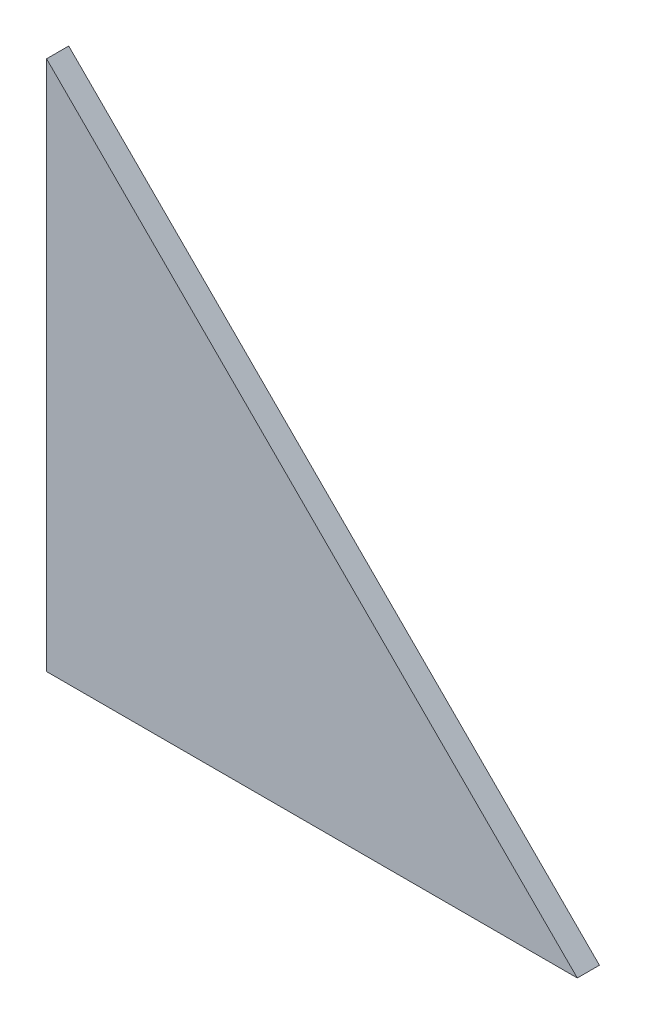
ISO-10303-21;
HEADER;
FILE_DESCRIPTION(('STEP AP214'),'2;1');
FILE_NAME('part.step','',(''),(''),'','','');
FILE_SCHEMA(('AUTOMOTIVE_DESIGN { 1 0 10303 214 1 1 1 1 }'));
ENDSEC;
DATA;
#1=APPLICATION_CONTEXT('core data for automotive mechanical design processes');
#2=APPLICATION_PROTOCOL_DEFINITION('international standard','automotive_design',2000,#1);
#3=PRODUCT_CONTEXT('',#1,'mechanical');
#4=PRODUCT('Part','Part','',(#3));
#5=PRODUCT_RELATED_PRODUCT_CATEGORY('part','',(#4));
#6=PRODUCT_DEFINITION_FORMATION('','',#4);
#7=PRODUCT_DEFINITION_CONTEXT('part definition',#1,'design');
#8=PRODUCT_DEFINITION('design','',#6,#7);
#9=PRODUCT_DEFINITION_SHAPE('','',#8);
#10=(LENGTH_UNIT() NAMED_UNIT(*) SI_UNIT(.MILLI.,.METRE.));
#11=(NAMED_UNIT(*) PLANE_ANGLE_UNIT() SI_UNIT($,.RADIAN.));
#12=(NAMED_UNIT(*) SI_UNIT($,.STERADIAN.) SOLID_ANGLE_UNIT());
#13=UNCERTAINTY_MEASURE_WITH_UNIT(LENGTH_MEASURE(1.E-05),#10,'distance_accuracy_value','');
#14=(GEOMETRIC_REPRESENTATION_CONTEXT(3) GLOBAL_UNCERTAINTY_ASSIGNED_CONTEXT((#13)) GLOBAL_UNIT_ASSIGNED_CONTEXT((#10,
#11,#12)) REPRESENTATION_CONTEXT('',''));
#15=CARTESIAN_POINT('',(0.,0.,0.));
#16=DIRECTION('',(0.,0.,1.));
#17=DIRECTION('',(1.,0.,0.));
#18=AXIS2_PLACEMENT_3D('',#15,#16,#17);
#19=CARTESIAN_POINT('',(0.,0.,5.));
#20=DIRECTION('',(0.,1.,0.));
#21=DIRECTION('',(0.,0.,1.));
#22=AXIS2_PLACEMENT_3D('',#19,#20,#21);
#23=PLANE('',#22);
#24=DIRECTION('',(1.,0.,0.));
#25=VECTOR('',#24,1.);
#26=CARTESIAN_POINT('',(0.,0.,0.));
#27=LINE('',#26,#25);
#28=CARTESIAN_POINT('',(0.,0.,0.));
#29=VERTEX_POINT('',#28);
#30=CARTESIAN_POINT('',(120.,0.,0.));
#31=VERTEX_POINT('',#30);
#32=EDGE_CURVE('E79',#29,#31,#27,.T.);
#33=ORIENTED_EDGE('',*,*,#32,.T.);
#34=DIRECTION('',(0.,0.,-1.));
#35=VECTOR('',#34,1.);
#36=CARTESIAN_POINT('',(120.,0.,5.));
#37=LINE('',#36,#35);
#38=CARTESIAN_POINT('',(120.,0.,5.));
#39=VERTEX_POINT('',#38);
#40=EDGE_CURVE('E11',#39,#31,#37,.T.);
#41=ORIENTED_EDGE('',*,*,#40,.F.);
#42=DIRECTION('',(1.,0.,0.));
#43=VECTOR('',#42,1.);
#44=CARTESIAN_POINT('',(0.,0.,5.));
#45=LINE('',#44,#43);
#46=CARTESIAN_POINT('',(0.,0.,5.));
#47=VERTEX_POINT('',#46);
#48=EDGE_CURVE('E74',#47,#39,#45,.T.);
#49=ORIENTED_EDGE('',*,*,#48,.F.);
#50=DIRECTION('',(0.,0.,-1.));
#51=VECTOR('',#50,1.);
#52=CARTESIAN_POINT('',(0.,0.,5.));
#53=LINE('',#52,#51);
#54=EDGE_CURVE('E49',#47,#29,#53,.T.);
#55=ORIENTED_EDGE('',*,*,#54,.T.);
#56=EDGE_LOOP('',(#33,#41,#49,#55));
#57=FACE_BOUND('',#56,.T.);
#58=ADVANCED_FACE('F33',(#57),#23,.F.);
#59=CARTESIAN_POINT('',(120.,0.,5.));
#60=DIRECTION('',(-0.707106781186548,-0.707106781186548,0.));
#61=DIRECTION('',(0.707106781186548,-0.707106781186548,0.));
#62=AXIS2_PLACEMENT_3D('',#59,#60,#61);
#63=PLANE('',#62);
#64=DIRECTION('',(-0.707106781186547,0.707106781186547,0.));
#65=VECTOR('',#64,1.);
#66=CARTESIAN_POINT('',(120.,0.,0.));
#67=LINE('',#66,#65);
#68=CARTESIAN_POINT('',(0.,120.,0.));
#69=VERTEX_POINT('',#68);
#70=EDGE_CURVE('E82',#31,#69,#67,.T.);
#71=ORIENTED_EDGE('',*,*,#70,.T.);
#72=DIRECTION('',(0.,0.,-1.));
#73=VECTOR('',#72,1.);
#74=CARTESIAN_POINT('',(0.,120.,5.));
#75=LINE('',#74,#73);
#76=CARTESIAN_POINT('',(0.,120.,5.));
#77=VERTEX_POINT('',#76);
#78=EDGE_CURVE('E41',#77,#69,#75,.T.);
#79=ORIENTED_EDGE('',*,*,#78,.F.);
#80=DIRECTION('',(-0.707106781186547,0.707106781186547,0.));
#81=VECTOR('',#80,1.);
#82=CARTESIAN_POINT('',(120.,0.,5.));
#83=LINE('',#82,#81);
#84=EDGE_CURVE('E67',#39,#77,#83,.T.);
#85=ORIENTED_EDGE('',*,*,#84,.F.);
#86=ORIENTED_EDGE('',*,*,#40,.T.);
#87=EDGE_LOOP('',(#71,#79,#85,#86));
#88=FACE_BOUND('',#87,.T.);
#89=ADVANCED_FACE('F69',(#88),#63,.F.);
#90=CARTESIAN_POINT('',(0.,0.,5.));
#91=DIRECTION('',(-1.,0.,0.));
#92=DIRECTION('',(0.,0.,1.));
#93=AXIS2_PLACEMENT_3D('',#90,#91,#92);
#94=PLANE('',#93);
#95=DIRECTION('',(0.,1.,0.));
#96=VECTOR('',#95,1.);
#97=CARTESIAN_POINT('',(0.,0.,0.));
#98=LINE('',#97,#96);
#99=EDGE_CURVE('E77',#29,#69,#98,.T.);
#100=ORIENTED_EDGE('',*,*,#99,.F.);
#101=ORIENTED_EDGE('',*,*,#54,.F.);
#102=DIRECTION('',(0.,1.,0.));
#103=VECTOR('',#102,1.);
#104=CARTESIAN_POINT('',(0.,0.,5.));
#105=LINE('',#104,#103);
#106=EDGE_CURVE('E73',#47,#77,#105,.T.);
#107=ORIENTED_EDGE('',*,*,#106,.T.);
#108=ORIENTED_EDGE('',*,*,#78,.T.);
#109=EDGE_LOOP('',(#100,#101,#107,#108));
#110=FACE_BOUND('',#109,.T.);
#111=ADVANCED_FACE('F88',(#110),#94,.T.);
#112=CARTESIAN_POINT('',(0.,0.,5.));
#113=DIRECTION('',(0.,0.,1.));
#114=DIRECTION('',(1.,0.,0.));
#115=AXIS2_PLACEMENT_3D('',#112,#113,#114);
#116=PLANE('',#115);
#117=ORIENTED_EDGE('',*,*,#48,.T.);
#118=ORIENTED_EDGE('',*,*,#84,.T.);
#119=ORIENTED_EDGE('',*,*,#106,.F.);
#120=EDGE_LOOP('',(#117,#118,#119));
#121=FACE_BOUND('',#120,.T.);
#122=ADVANCED_FACE('F76',(#121),#116,.T.);
#123=CARTESIAN_POINT('',(0.,0.,0.));
#124=DIRECTION('',(0.,0.,1.));
#125=DIRECTION('',(1.,0.,0.));
#126=AXIS2_PLACEMENT_3D('',#123,#124,#125);
#127=PLANE('',#126);
#128=ORIENTED_EDGE('',*,*,#32,.F.);
#129=ORIENTED_EDGE('',*,*,#99,.T.);
#130=ORIENTED_EDGE('',*,*,#70,.F.);
#131=EDGE_LOOP('',(#128,#129,#130));
#132=FACE_BOUND('',#131,.T.);
#133=ADVANCED_FACE('F95',(#132),#127,.F.);
#134=CLOSED_SHELL('',(#58,#89,#111,#122,#133));
#135=MANIFOLD_SOLID_BREP('B2',#134);
#136=ADVANCED_BREP_SHAPE_REPRESENTATION('',(#18,#135),#14);
#137=SHAPE_DEFINITION_REPRESENTATION(#9,#136);
ENDSEC;
END-ISO-10303-21;
